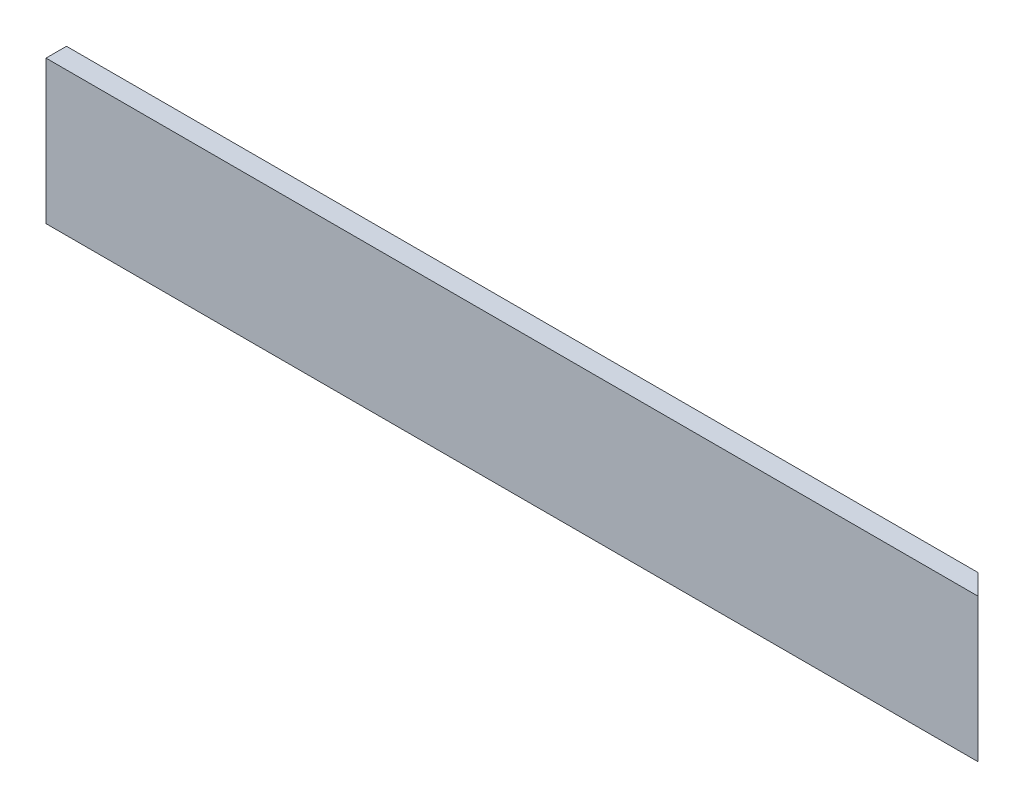
ISO-10303-21;
HEADER;
FILE_DESCRIPTION(('STEP AP214'),'2;1');
FILE_NAME('part.step','',(''),(''),'','','');
FILE_SCHEMA(('AUTOMOTIVE_DESIGN { 1 0 10303 214 1 1 1 1 }'));
ENDSEC;
DATA;
#1=APPLICATION_CONTEXT('core data for automotive mechanical design processes');
#2=APPLICATION_PROTOCOL_DEFINITION('international standard','automotive_design',2000,#1);
#3=PRODUCT_CONTEXT('',#1,'mechanical');
#4=PRODUCT('Part','Part','',(#3));
#5=PRODUCT_RELATED_PRODUCT_CATEGORY('part','',(#4));
#6=PRODUCT_DEFINITION_FORMATION('','',#4);
#7=PRODUCT_DEFINITION_CONTEXT('part definition',#1,'design');
#8=PRODUCT_DEFINITION('design','',#6,#7);
#9=PRODUCT_DEFINITION_SHAPE('','',#8);
#10=(LENGTH_UNIT() NAMED_UNIT(*) SI_UNIT(.MILLI.,.METRE.));
#11=(NAMED_UNIT(*) PLANE_ANGLE_UNIT() SI_UNIT($,.RADIAN.));
#12=(NAMED_UNIT(*) SI_UNIT($,.STERADIAN.) SOLID_ANGLE_UNIT());
#13=UNCERTAINTY_MEASURE_WITH_UNIT(LENGTH_MEASURE(1.E-05),#10,'distance_accuracy_value','');
#14=(GEOMETRIC_REPRESENTATION_CONTEXT(3) GLOBAL_UNCERTAINTY_ASSIGNED_CONTEXT((#13)) GLOBAL_UNIT_ASSIGNED_CONTEXT((#10,
#11,#12)) REPRESENTATION_CONTEXT('',''));
#15=CARTESIAN_POINT('',(0.,0.,0.));
#16=DIRECTION('',(0.,0.,1.));
#17=DIRECTION('',(1.,0.,0.));
#18=AXIS2_PLACEMENT_3D('',#15,#16,#17);
#19=CARTESIAN_POINT('',(-180.965129533679,22.1361658031088,12.7));
#20=DIRECTION('',(1.,0.,0.));
#21=DIRECTION('',(0.,1.,0.));
#22=AXIS2_PLACEMENT_3D('',#19,#20,#21);
#23=PLANE('',#22);
#24=DIRECTION('',(0.,-1.,0.));
#25=VECTOR('',#24,1.);
#26=CARTESIAN_POINT('',(-180.965129533679,22.1361658031088,0.));
#27=LINE('',#26,#25);
#28=CARTESIAN_POINT('',(-180.965129533679,22.1361658031088,0.));
#29=VERTEX_POINT('',#28);
#30=CARTESIAN_POINT('',(-180.965129533679,-66.7638341968912,0.));
#31=VERTEX_POINT('',#30);
#32=EDGE_CURVE('E93',#29,#31,#27,.T.);
#33=ORIENTED_EDGE('',*,*,#32,.T.);
#34=DIRECTION('',(0.,0.,-1.));
#35=VECTOR('',#34,1.);
#36=CARTESIAN_POINT('',(-180.965129533679,-66.7638341968912,12.7));
#37=LINE('',#36,#35);
#38=CARTESIAN_POINT('',(-180.965129533679,-66.7638341968912,12.7));
#39=VERTEX_POINT('',#38);
#40=EDGE_CURVE('E11',#39,#31,#37,.T.);
#41=ORIENTED_EDGE('',*,*,#40,.F.);
#42=DIRECTION('',(0.,-1.,0.));
#43=VECTOR('',#42,1.);
#44=CARTESIAN_POINT('',(-180.965129533679,22.1361658031088,12.7));
#45=LINE('',#44,#43);
#46=CARTESIAN_POINT('',(-180.965129533679,22.1361658031088,12.7));
#47=VERTEX_POINT('',#46);
#48=EDGE_CURVE('E87',#47,#39,#45,.T.);
#49=ORIENTED_EDGE('',*,*,#48,.F.);
#50=DIRECTION('',(0.,0.,-1.));
#51=VECTOR('',#50,1.);
#52=CARTESIAN_POINT('',(-180.965129533679,22.1361658031088,12.7));
#53=LINE('',#52,#51);
#54=EDGE_CURVE('E47',#47,#29,#53,.T.);
#55=ORIENTED_EDGE('',*,*,#54,.T.);
#56=EDGE_LOOP('',(#33,#41,#49,#55));
#57=FACE_BOUND('',#56,.T.);
#58=ADVANCED_FACE('F39',(#57),#23,.F.);
#59=CARTESIAN_POINT('',(-180.965129533679,-66.7638341968912,12.7));
#60=DIRECTION('',(0.,1.,0.));
#61=DIRECTION('',(0.,0.,1.));
#62=AXIS2_PLACEMENT_3D('',#59,#60,#61);
#63=PLANE('',#62);
#64=DIRECTION('',(1.,0.,0.));
#65=VECTOR('',#64,1.);
#66=CARTESIAN_POINT('',(-180.965129533679,-66.7638341968912,0.));
#67=LINE('',#66,#65);
#68=CARTESIAN_POINT('',(384.184870466322,-66.7638341968912,0.));
#69=VERTEX_POINT('',#68);
#70=EDGE_CURVE('E88',#31,#69,#67,.T.);
#71=ORIENTED_EDGE('',*,*,#70,.T.);
#72=DIRECTION('',(0.707106781186544,0.,0.707106781186551));
#73=VECTOR('',#72,1.);
#74=CARTESIAN_POINT('',(396.884870466321,-66.7638341968912,12.7));
#75=LINE('',#74,#73);
#76=CARTESIAN_POINT('',(396.884870466321,-66.7638341968912,12.7));
#77=VERTEX_POINT('',#76);
#78=EDGE_CURVE('E54',#69,#77,#75,.T.);
#79=ORIENTED_EDGE('',*,*,#78,.T.);
#80=DIRECTION('',(1.,0.,0.));
#81=VECTOR('',#80,1.);
#82=CARTESIAN_POINT('',(-180.965129533679,-66.7638341968912,12.7));
#83=LINE('',#82,#81);
#84=EDGE_CURVE('E110',#39,#77,#83,.T.);
#85=ORIENTED_EDGE('',*,*,#84,.F.);
#86=ORIENTED_EDGE('',*,*,#40,.T.);
#87=EDGE_LOOP('',(#71,#79,#85,#86));
#88=FACE_BOUND('',#87,.T.);
#89=ADVANCED_FACE('F120',(#88),#63,.F.);
#90=CARTESIAN_POINT('',(-180.965129533679,22.1361658031088,12.7));
#91=DIRECTION('',(0.,-1.,0.));
#92=DIRECTION('',(0.,0.,-1.));
#93=AXIS2_PLACEMENT_3D('',#90,#91,#92);
#94=PLANE('',#93);
#95=DIRECTION('',(-1.,0.,0.));
#96=VECTOR('',#95,1.);
#97=CARTESIAN_POINT('',(-180.965129533679,22.1361658031088,12.7));
#98=LINE('',#97,#96);
#99=CARTESIAN_POINT('',(396.884870466321,22.1361658031088,12.7));
#100=VERTEX_POINT('',#99);
#101=EDGE_CURVE('E63',#100,#47,#98,.T.);
#102=ORIENTED_EDGE('',*,*,#101,.F.);
#103=DIRECTION('',(0.707106781186544,0.,0.707106781186551));
#104=VECTOR('',#103,1.);
#105=CARTESIAN_POINT('',(396.884870466321,22.1361658031088,12.7));
#106=LINE('',#105,#104);
#107=CARTESIAN_POINT('',(384.184870466322,22.1361658031088,0.));
#108=VERTEX_POINT('',#107);
#109=EDGE_CURVE('E83',#108,#100,#106,.T.);
#110=ORIENTED_EDGE('',*,*,#109,.F.);
#111=DIRECTION('',(-1.,0.,0.));
#112=VECTOR('',#111,1.);
#113=CARTESIAN_POINT('',(-180.965129533679,22.1361658031088,0.));
#114=LINE('',#113,#112);
#115=EDGE_CURVE('E77',#108,#29,#114,.T.);
#116=ORIENTED_EDGE('',*,*,#115,.T.);
#117=ORIENTED_EDGE('',*,*,#54,.F.);
#118=EDGE_LOOP('',(#102,#110,#116,#117));
#119=FACE_BOUND('',#118,.T.);
#120=ADVANCED_FACE('F79',(#119),#94,.F.);
#121=CARTESIAN_POINT('',(0.,0.,12.7));
#122=DIRECTION('',(0.,0.,1.));
#123=DIRECTION('',(1.,0.,0.));
#124=AXIS2_PLACEMENT_3D('',#121,#122,#123);
#125=PLANE('',#124);
#126=ORIENTED_EDGE('',*,*,#48,.T.);
#127=ORIENTED_EDGE('',*,*,#84,.T.);
#128=DIRECTION('',(0.,1.,0.));
#129=VECTOR('',#128,1.);
#130=CARTESIAN_POINT('',(396.884870466321,22.1361658031088,12.7));
#131=LINE('',#130,#129);
#132=EDGE_CURVE('E107',#77,#100,#131,.T.);
#133=ORIENTED_EDGE('',*,*,#132,.T.);
#134=ORIENTED_EDGE('',*,*,#101,.T.);
#135=EDGE_LOOP('',(#126,#127,#133,#134));
#136=FACE_BOUND('',#135,.T.);
#137=ADVANCED_FACE('F123',(#136),#125,.T.);
#138=CARTESIAN_POINT('',(0.,0.,0.));
#139=DIRECTION('',(0.,0.,1.));
#140=DIRECTION('',(1.,0.,0.));
#141=AXIS2_PLACEMENT_3D('',#138,#139,#140);
#142=PLANE('',#141);
#143=ORIENTED_EDGE('',*,*,#115,.F.);
#144=DIRECTION('',(0.,1.,0.));
#145=VECTOR('',#144,1.);
#146=CARTESIAN_POINT('',(384.184870466322,-66.7638341968912,0.));
#147=LINE('',#146,#145);
#148=EDGE_CURVE('E98',#69,#108,#147,.T.);
#149=ORIENTED_EDGE('',*,*,#148,.F.);
#150=ORIENTED_EDGE('',*,*,#70,.F.);
#151=ORIENTED_EDGE('',*,*,#32,.F.);
#152=EDGE_LOOP('',(#143,#149,#150,#151));
#153=FACE_BOUND('',#152,.T.);
#154=ADVANCED_FACE('F95',(#153),#142,.F.);
#155=CARTESIAN_POINT('',(396.884870466321,-66.7638341968912,12.7));
#156=DIRECTION('',(-0.707106781186551,0.,0.707106781186544));
#157=DIRECTION('',(0.707106781186544,0.,0.707106781186551));
#158=AXIS2_PLACEMENT_3D('',#155,#156,#157);
#159=PLANE('',#158);
#160=ORIENTED_EDGE('',*,*,#109,.T.);
#161=ORIENTED_EDGE('',*,*,#132,.F.);
#162=ORIENTED_EDGE('',*,*,#78,.F.);
#163=ORIENTED_EDGE('',*,*,#148,.T.);
#164=EDGE_LOOP('',(#160,#161,#162,#163));
#165=FACE_BOUND('',#164,.T.);
#166=ADVANCED_FACE('F124',(#165),#159,.F.);
#167=CLOSED_SHELL('',(#58,#89,#120,#137,#154,#166));
#168=MANIFOLD_SOLID_BREP('B2',#167);
#169=ADVANCED_BREP_SHAPE_REPRESENTATION('',(#18,#168),#14);
#170=SHAPE_DEFINITION_REPRESENTATION(#9,#169);
ENDSEC;
END-ISO-10303-21;
